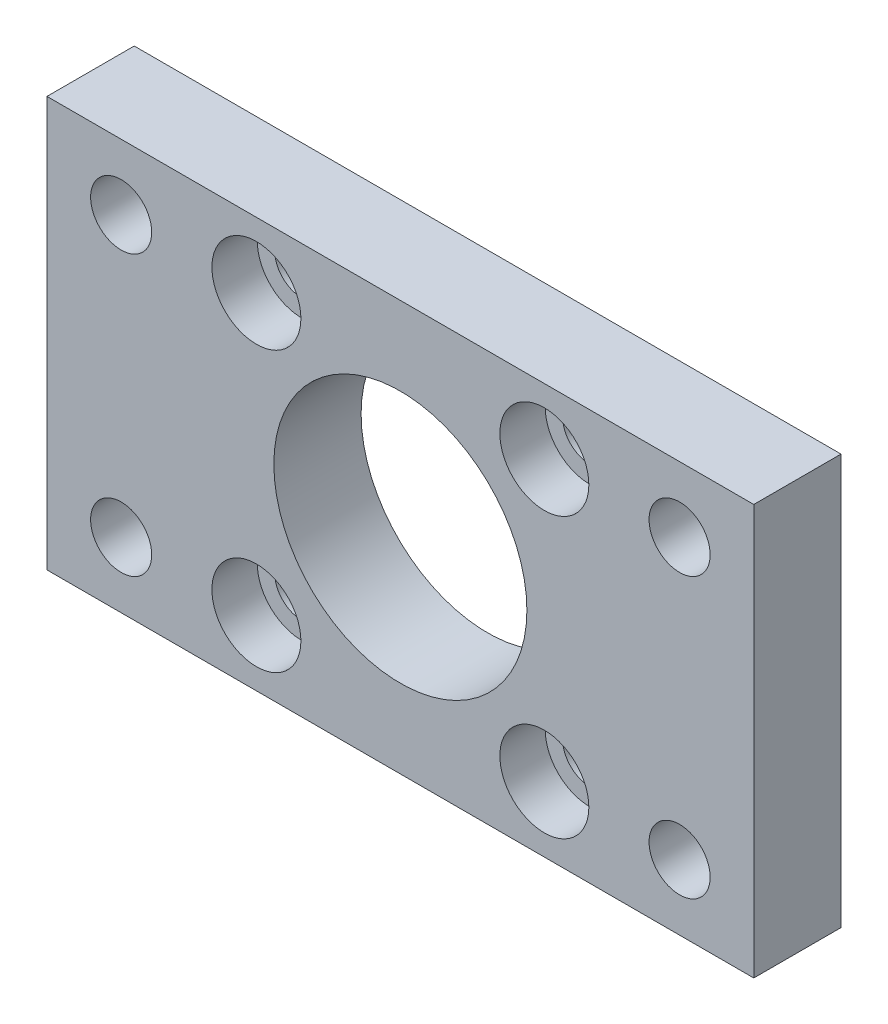
ISO-10303-21;
HEADER;
FILE_DESCRIPTION(('STEP AP214'),'2;1');
FILE_NAME('part.step','',(''),(''),'','','');
FILE_SCHEMA(('AUTOMOTIVE_DESIGN { 1 0 10303 214 1 1 1 1 }'));
ENDSEC;
DATA;
#1=APPLICATION_CONTEXT('core data for automotive mechanical design processes');
#2=APPLICATION_PROTOCOL_DEFINITION('international standard','automotive_design',2000,#1);
#3=PRODUCT_CONTEXT('',#1,'mechanical');
#4=PRODUCT('Part','Part','',(#3));
#5=PRODUCT_RELATED_PRODUCT_CATEGORY('part','',(#4));
#6=PRODUCT_DEFINITION_FORMATION('','',#4);
#7=PRODUCT_DEFINITION_CONTEXT('part definition',#1,'design');
#8=PRODUCT_DEFINITION('design','',#6,#7);
#9=PRODUCT_DEFINITION_SHAPE('','',#8);
#10=(LENGTH_UNIT() NAMED_UNIT(*) SI_UNIT(.MILLI.,.METRE.));
#11=(NAMED_UNIT(*) PLANE_ANGLE_UNIT() SI_UNIT($,.RADIAN.));
#12=(NAMED_UNIT(*) SI_UNIT($,.STERADIAN.) SOLID_ANGLE_UNIT());
#13=UNCERTAINTY_MEASURE_WITH_UNIT(LENGTH_MEASURE(1.E-05),#10,'distance_accuracy_value','');
#14=(GEOMETRIC_REPRESENTATION_CONTEXT(3) GLOBAL_UNCERTAINTY_ASSIGNED_CONTEXT((#13)) GLOBAL_UNIT_ASSIGNED_CONTEXT((#10,
#11,#12)) REPRESENTATION_CONTEXT('',''));
#15=CARTESIAN_POINT('',(0.,0.,0.));
#16=DIRECTION('',(0.,0.,1.));
#17=DIRECTION('',(1.,0.,0.));
#18=AXIS2_PLACEMENT_3D('',#15,#16,#17);
#19=CARTESIAN_POINT('',(57.,39.5,10.));
#20=DIRECTION('',(0.,0.,-1.));
#21=DIRECTION('',(-1.,0.,0.));
#22=AXIS2_PLACEMENT_3D('',#19,#20,#21);
#23=CYLINDRICAL_SURFACE('',#22,3.1);
#24=CARTESIAN_POINT('',(57.,39.5,0.));
#25=DIRECTION('',(0.,0.,1.));
#26=DIRECTION('',(-1.,0.,0.));
#27=AXIS2_PLACEMENT_3D('',#24,#25,#26);
#28=CIRCLE('',#27,3.1);
#29=CARTESIAN_POINT('',(53.9,39.5,0.));
#30=VERTEX_POINT('',#29);
#31=EDGE_CURVE('E138',#30,#30,#28,.T.);
#32=ORIENTED_EDGE('',*,*,#31,.F.);
#33=EDGE_LOOP('',(#32));
#34=FACE_BOUND('',#33,.T.);
#35=CARTESIAN_POINT('',(57.,39.5,4.8));
#36=DIRECTION('',(0.,0.,1.));
#37=DIRECTION('',(1.,0.,0.));
#38=AXIS2_PLACEMENT_3D('',#35,#36,#37);
#39=CIRCLE('',#38,3.1);
#40=CARTESIAN_POINT('',(60.1,39.5,4.8));
#41=VERTEX_POINT('',#40);
#42=EDGE_CURVE('E36',#41,#41,#39,.T.);
#43=ORIENTED_EDGE('',*,*,#42,.T.);
#44=EDGE_LOOP('',(#43));
#45=FACE_BOUND('',#44,.T.);
#46=ADVANCED_FACE('F32',(#34,#45),#23,.F.);
#47=CARTESIAN_POINT('',(57.,7.50000000000001,10.));
#48=DIRECTION('',(0.,0.,-1.));
#49=DIRECTION('',(-1.,0.,0.));
#50=AXIS2_PLACEMENT_3D('',#47,#48,#49);
#51=CYLINDRICAL_SURFACE('',#50,3.1);
#52=CARTESIAN_POINT('',(57.,7.50000000000001,0.));
#53=DIRECTION('',(0.,0.,1.));
#54=DIRECTION('',(1.,0.,0.));
#55=AXIS2_PLACEMENT_3D('',#52,#53,#54);
#56=CIRCLE('',#55,3.1);
#57=CARTESIAN_POINT('',(60.1,7.50000000000001,0.));
#58=VERTEX_POINT('',#57);
#59=EDGE_CURVE('E135',#58,#58,#56,.T.);
#60=ORIENTED_EDGE('',*,*,#59,.F.);
#61=EDGE_LOOP('',(#60));
#62=FACE_BOUND('',#61,.T.);
#63=CARTESIAN_POINT('',(57.,7.50000000000001,4.8));
#64=DIRECTION('',(0.,0.,1.));
#65=DIRECTION('',(1.,0.,0.));
#66=AXIS2_PLACEMENT_3D('',#63,#64,#65);
#67=CIRCLE('',#66,3.1);
#68=CARTESIAN_POINT('',(60.1,7.50000000000001,4.8));
#69=VERTEX_POINT('',#68);
#70=EDGE_CURVE('E116',#69,#69,#67,.T.);
#71=ORIENTED_EDGE('',*,*,#70,.T.);
#72=EDGE_LOOP('',(#71));
#73=FACE_BOUND('',#72,.T.);
#74=ADVANCED_FACE('F193',(#62,#73),#51,.F.);
#75=CARTESIAN_POINT('',(24.,7.50000000000001,10.));
#76=DIRECTION('',(0.,0.,-1.));
#77=DIRECTION('',(-1.,0.,0.));
#78=AXIS2_PLACEMENT_3D('',#75,#76,#77);
#79=CYLINDRICAL_SURFACE('',#78,3.1);
#80=CARTESIAN_POINT('',(24.,7.50000000000001,0.));
#81=DIRECTION('',(0.,0.,1.));
#82=DIRECTION('',(-1.,0.,0.));
#83=AXIS2_PLACEMENT_3D('',#80,#81,#82);
#84=CIRCLE('',#83,3.1);
#85=CARTESIAN_POINT('',(20.9,7.50000000000001,0.));
#86=VERTEX_POINT('',#85);
#87=EDGE_CURVE('E112',#86,#86,#84,.T.);
#88=ORIENTED_EDGE('',*,*,#87,.F.);
#89=EDGE_LOOP('',(#88));
#90=FACE_BOUND('',#89,.T.);
#91=CARTESIAN_POINT('',(24.,7.50000000000001,4.8));
#92=DIRECTION('',(0.,0.,1.));
#93=DIRECTION('',(1.,0.,0.));
#94=AXIS2_PLACEMENT_3D('',#91,#92,#93);
#95=CIRCLE('',#94,3.1);
#96=CARTESIAN_POINT('',(27.1,7.50000000000001,4.8));
#97=VERTEX_POINT('',#96);
#98=EDGE_CURVE('E114',#97,#97,#95,.T.);
#99=ORIENTED_EDGE('',*,*,#98,.T.);
#100=EDGE_LOOP('',(#99));
#101=FACE_BOUND('',#100,.T.);
#102=ADVANCED_FACE('F199',(#90,#101),#79,.F.);
#103=CARTESIAN_POINT('',(24.,39.5,10.));
#104=DIRECTION('',(0.,0.,-1.));
#105=DIRECTION('',(-1.,0.,0.));
#106=AXIS2_PLACEMENT_3D('',#103,#104,#105);
#107=CYLINDRICAL_SURFACE('',#106,3.1);
#108=CARTESIAN_POINT('',(24.,39.5,0.));
#109=DIRECTION('',(0.,0.,1.));
#110=DIRECTION('',(1.,0.,0.));
#111=AXIS2_PLACEMENT_3D('',#108,#109,#110);
#112=CIRCLE('',#111,3.1);
#113=CARTESIAN_POINT('',(27.1,39.5,0.));
#114=VERTEX_POINT('',#113);
#115=EDGE_CURVE('E141',#114,#114,#112,.T.);
#116=ORIENTED_EDGE('',*,*,#115,.F.);
#117=EDGE_LOOP('',(#116));
#118=FACE_BOUND('',#117,.T.);
#119=CARTESIAN_POINT('',(24.,39.5,4.8));
#120=DIRECTION('',(0.,0.,1.));
#121=DIRECTION('',(1.,0.,0.));
#122=AXIS2_PLACEMENT_3D('',#119,#120,#121);
#123=CIRCLE('',#122,3.1);
#124=CARTESIAN_POINT('',(27.1,39.5,4.8));
#125=VERTEX_POINT('',#124);
#126=EDGE_CURVE('E109',#125,#125,#123,.T.);
#127=ORIENTED_EDGE('',*,*,#126,.T.);
#128=EDGE_LOOP('',(#127));
#129=FACE_BOUND('',#128,.T.);
#130=ADVANCED_FACE('F205',(#118,#129),#107,.F.);
#131=CARTESIAN_POINT('',(0.,0.,10.));
#132=DIRECTION('',(0.,0.,-1.));
#133=DIRECTION('',(-1.,0.,0.));
#134=AXIS2_PLACEMENT_3D('',#131,#132,#133);
#135=PLANE('',#134);
#136=CARTESIAN_POINT('',(24.,7.50000000000001,10.));
#137=DIRECTION('',(0.,0.,1.));
#138=DIRECTION('',(1.,0.,0.));
#139=AXIS2_PLACEMENT_3D('',#136,#137,#138);
#140=CIRCLE('',#139,5.1);
#141=CARTESIAN_POINT('',(29.1,7.50000000000001,10.));
#142=VERTEX_POINT('',#141);
#143=EDGE_CURVE('E247',#142,#142,#140,.T.);
#144=ORIENTED_EDGE('',*,*,#143,.F.);
#145=EDGE_LOOP('',(#144));
#146=FACE_BOUND('',#145,.T.);
#147=CARTESIAN_POINT('',(57.,7.50000000000001,10.));
#148=DIRECTION('',(0.,0.,1.));
#149=DIRECTION('',(1.,0.,0.));
#150=AXIS2_PLACEMENT_3D('',#147,#148,#149);
#151=CIRCLE('',#150,5.1);
#152=CARTESIAN_POINT('',(62.1,7.50000000000001,10.));
#153=VERTEX_POINT('',#152);
#154=EDGE_CURVE('E255',#153,#153,#151,.T.);
#155=ORIENTED_EDGE('',*,*,#154,.F.);
#156=EDGE_LOOP('',(#155));
#157=FACE_BOUND('',#156,.T.);
#158=CARTESIAN_POINT('',(57.,39.5,10.));
#159=DIRECTION('',(0.,0.,1.));
#160=DIRECTION('',(1.,0.,0.));
#161=AXIS2_PLACEMENT_3D('',#158,#159,#160);
#162=CIRCLE('',#161,5.1);
#163=CARTESIAN_POINT('',(62.1,39.5,10.));
#164=VERTEX_POINT('',#163);
#165=EDGE_CURVE('E260',#164,#164,#162,.T.);
#166=ORIENTED_EDGE('',*,*,#165,.F.);
#167=EDGE_LOOP('',(#166));
#168=FACE_BOUND('',#167,.T.);
#169=CARTESIAN_POINT('',(24.,39.5,10.));
#170=DIRECTION('',(0.,0.,1.));
#171=DIRECTION('',(1.,0.,0.));
#172=AXIS2_PLACEMENT_3D('',#169,#170,#171);
#173=CIRCLE('',#172,5.1);
#174=CARTESIAN_POINT('',(29.1,39.5,10.));
#175=VERTEX_POINT('',#174);
#176=EDGE_CURVE('E122',#175,#175,#173,.T.);
#177=ORIENTED_EDGE('',*,*,#176,.F.);
#178=EDGE_LOOP('',(#177));
#179=FACE_BOUND('',#178,.T.);
#180=DIRECTION('',(0.,-1.,0.));
#181=VECTOR('',#180,1.);
#182=CARTESIAN_POINT('',(0.,0.,10.));
#183=LINE('',#182,#181);
#184=CARTESIAN_POINT('',(0.,47.,10.));
#185=VERTEX_POINT('',#184);
#186=CARTESIAN_POINT('',(0.,0.,10.));
#187=VERTEX_POINT('',#186);
#188=EDGE_CURVE('E87',#185,#187,#183,.T.);
#189=ORIENTED_EDGE('',*,*,#188,.T.);
#190=DIRECTION('',(1.,0.,0.));
#191=VECTOR('',#190,1.);
#192=CARTESIAN_POINT('',(0.,0.,10.));
#193=LINE('',#192,#191);
#194=CARTESIAN_POINT('',(81.,0.,10.));
#195=VERTEX_POINT('',#194);
#196=EDGE_CURVE('E81',#187,#195,#193,.T.);
#197=ORIENTED_EDGE('',*,*,#196,.T.);
#198=DIRECTION('',(0.,1.,0.));
#199=VECTOR('',#198,1.);
#200=CARTESIAN_POINT('',(81.,0.,10.));
#201=LINE('',#200,#199);
#202=CARTESIAN_POINT('',(81.,47.,10.));
#203=VERTEX_POINT('',#202);
#204=EDGE_CURVE('E85',#195,#203,#201,.T.);
#205=ORIENTED_EDGE('',*,*,#204,.T.);
#206=DIRECTION('',(-1.,0.,0.));
#207=VECTOR('',#206,1.);
#208=CARTESIAN_POINT('',(0.,47.,10.));
#209=LINE('',#208,#207);
#210=EDGE_CURVE('E51',#203,#185,#209,.T.);
#211=ORIENTED_EDGE('',*,*,#210,.T.);
#212=EDGE_LOOP('',(#189,#197,#205,#211));
#213=FACE_BOUND('',#212,.T.);
#214=CARTESIAN_POINT('',(40.5,23.5,10.));
#215=DIRECTION('',(0.,0.,1.));
#216=DIRECTION('',(1.,0.,0.));
#217=AXIS2_PLACEMENT_3D('',#214,#215,#216);
#218=CIRCLE('',#217,14.5);
#219=CARTESIAN_POINT('',(55.,23.5,10.));
#220=VERTEX_POINT('',#219);
#221=EDGE_CURVE('E103',#220,#220,#218,.T.);
#222=ORIENTED_EDGE('',*,*,#221,.F.);
#223=EDGE_LOOP('',(#222));
#224=FACE_BOUND('',#223,.T.);
#225=CARTESIAN_POINT('',(8.50000000000001,39.5,10.));
#226=DIRECTION('',(0.,0.,1.));
#227=DIRECTION('',(1.,0.,0.));
#228=AXIS2_PLACEMENT_3D('',#225,#226,#227);
#229=CIRCLE('',#228,3.5);
#230=CARTESIAN_POINT('',(12.,39.5,10.));
#231=VERTEX_POINT('',#230);
#232=EDGE_CURVE('E163',#231,#231,#229,.T.);
#233=ORIENTED_EDGE('',*,*,#232,.F.);
#234=EDGE_LOOP('',(#233));
#235=FACE_BOUND('',#234,.T.);
#236=CARTESIAN_POINT('',(72.5,39.5,10.));
#237=DIRECTION('',(0.,0.,1.));
#238=DIRECTION('',(1.,0.,0.));
#239=AXIS2_PLACEMENT_3D('',#236,#237,#238);
#240=CIRCLE('',#239,3.49999999999999);
#241=CARTESIAN_POINT('',(76.,39.5,10.));
#242=VERTEX_POINT('',#241);
#243=EDGE_CURVE('E157',#242,#242,#240,.T.);
#244=ORIENTED_EDGE('',*,*,#243,.F.);
#245=EDGE_LOOP('',(#244));
#246=FACE_BOUND('',#245,.T.);
#247=CARTESIAN_POINT('',(72.5,7.50000000000001,10.));
#248=DIRECTION('',(0.,0.,1.));
#249=DIRECTION('',(1.,0.,0.));
#250=AXIS2_PLACEMENT_3D('',#247,#248,#249);
#251=CIRCLE('',#250,3.50000000000001);
#252=CARTESIAN_POINT('',(76.,7.50000000000001,10.));
#253=VERTEX_POINT('',#252);
#254=EDGE_CURVE('E151',#253,#253,#251,.T.);
#255=ORIENTED_EDGE('',*,*,#254,.F.);
#256=EDGE_LOOP('',(#255));
#257=FACE_BOUND('',#256,.T.);
#258=CARTESIAN_POINT('',(8.50000000000001,7.5,10.));
#259=DIRECTION('',(0.,0.,1.));
#260=DIRECTION('',(1.,0.,0.));
#261=AXIS2_PLACEMENT_3D('',#258,#259,#260);
#262=CIRCLE('',#261,3.5);
#263=CARTESIAN_POINT('',(12.,7.5,10.));
#264=VERTEX_POINT('',#263);
#265=EDGE_CURVE('E145',#264,#264,#262,.T.);
#266=ORIENTED_EDGE('',*,*,#265,.F.);
#267=EDGE_LOOP('',(#266));
#268=FACE_BOUND('',#267,.T.);
#269=ADVANCED_FACE('F82',(#146,#157,#168,#179,#213,#224,#235,#246,#257,#268),#135,.F.);
#270=CARTESIAN_POINT('',(0.,0.,0.));
#271=DIRECTION('',(0.,0.,-1.));
#272=DIRECTION('',(-1.,0.,0.));
#273=AXIS2_PLACEMENT_3D('',#270,#271,#272);
#274=PLANE('',#273);
#275=ORIENTED_EDGE('',*,*,#59,.T.);
#276=EDGE_LOOP('',(#275));
#277=FACE_BOUND('',#276,.T.);
#278=ORIENTED_EDGE('',*,*,#115,.T.);
#279=EDGE_LOOP('',(#278));
#280=FACE_BOUND('',#279,.T.);
#281=CARTESIAN_POINT('',(72.5,7.50000000000001,0.));
#282=DIRECTION('',(0.,0.,1.));
#283=DIRECTION('',(1.,0.,0.));
#284=AXIS2_PLACEMENT_3D('',#281,#282,#283);
#285=CIRCLE('',#284,3.50000000000001);
#286=CARTESIAN_POINT('',(76.,7.50000000000001,0.));
#287=VERTEX_POINT('',#286);
#288=EDGE_CURVE('E148',#287,#287,#285,.T.);
#289=ORIENTED_EDGE('',*,*,#288,.T.);
#290=EDGE_LOOP('',(#289));
#291=FACE_BOUND('',#290,.T.);
#292=CARTESIAN_POINT('',(8.50000000000001,39.5,0.));
#293=DIRECTION('',(0.,0.,1.));
#294=DIRECTION('',(1.,0.,0.));
#295=AXIS2_PLACEMENT_3D('',#292,#293,#294);
#296=CIRCLE('',#295,3.5);
#297=CARTESIAN_POINT('',(12.,39.5,0.));
#298=VERTEX_POINT('',#297);
#299=EDGE_CURVE('E160',#298,#298,#296,.T.);
#300=ORIENTED_EDGE('',*,*,#299,.T.);
#301=EDGE_LOOP('',(#300));
#302=FACE_BOUND('',#301,.T.);
#303=DIRECTION('',(0.,-1.,0.));
#304=VECTOR('',#303,1.);
#305=CARTESIAN_POINT('',(0.,0.,0.));
#306=LINE('',#305,#304);
#307=CARTESIAN_POINT('',(0.,47.,0.));
#308=VERTEX_POINT('',#307);
#309=CARTESIAN_POINT('',(0.,0.,0.));
#310=VERTEX_POINT('',#309);
#311=EDGE_CURVE('E100',#308,#310,#306,.T.);
#312=ORIENTED_EDGE('',*,*,#311,.F.);
#313=DIRECTION('',(-1.,0.,0.));
#314=VECTOR('',#313,1.);
#315=CARTESIAN_POINT('',(0.,47.,0.));
#316=LINE('',#315,#314);
#317=CARTESIAN_POINT('',(81.,47.,0.));
#318=VERTEX_POINT('',#317);
#319=EDGE_CURVE('E74',#318,#308,#316,.T.);
#320=ORIENTED_EDGE('',*,*,#319,.F.);
#321=DIRECTION('',(0.,1.,0.));
#322=VECTOR('',#321,1.);
#323=CARTESIAN_POINT('',(81.,0.,0.));
#324=LINE('',#323,#322);
#325=CARTESIAN_POINT('',(81.,0.,0.));
#326=VERTEX_POINT('',#325);
#327=EDGE_CURVE('E68',#326,#318,#324,.T.);
#328=ORIENTED_EDGE('',*,*,#327,.F.);
#329=DIRECTION('',(1.,0.,0.));
#330=VECTOR('',#329,1.);
#331=CARTESIAN_POINT('',(0.,0.,0.));
#332=LINE('',#331,#330);
#333=EDGE_CURVE('E91',#310,#326,#332,.T.);
#334=ORIENTED_EDGE('',*,*,#333,.F.);
#335=EDGE_LOOP('',(#312,#320,#328,#334));
#336=FACE_BOUND('',#335,.T.);
#337=CARTESIAN_POINT('',(40.5,23.5,0.));
#338=DIRECTION('',(0.,0.,1.));
#339=DIRECTION('',(1.,0.,0.));
#340=AXIS2_PLACEMENT_3D('',#337,#338,#339);
#341=CIRCLE('',#340,14.5);
#342=CARTESIAN_POINT('',(55.,23.5,0.));
#343=VERTEX_POINT('',#342);
#344=EDGE_CURVE('E166',#343,#343,#341,.T.);
#345=ORIENTED_EDGE('',*,*,#344,.T.);
#346=EDGE_LOOP('',(#345));
#347=FACE_BOUND('',#346,.T.);
#348=CARTESIAN_POINT('',(72.5,39.5,0.));
#349=DIRECTION('',(0.,0.,1.));
#350=DIRECTION('',(1.,0.,0.));
#351=AXIS2_PLACEMENT_3D('',#348,#349,#350);
#352=CIRCLE('',#351,3.49999999999999);
#353=CARTESIAN_POINT('',(76.,39.5,0.));
#354=VERTEX_POINT('',#353);
#355=EDGE_CURVE('E154',#354,#354,#352,.T.);
#356=ORIENTED_EDGE('',*,*,#355,.T.);
#357=EDGE_LOOP('',(#356));
#358=FACE_BOUND('',#357,.T.);
#359=CARTESIAN_POINT('',(8.50000000000001,7.5,0.));
#360=DIRECTION('',(0.,0.,1.));
#361=DIRECTION('',(1.,0.,0.));
#362=AXIS2_PLACEMENT_3D('',#359,#360,#361);
#363=CIRCLE('',#362,3.5);
#364=CARTESIAN_POINT('',(12.,7.5,0.));
#365=VERTEX_POINT('',#364);
#366=EDGE_CURVE('E144',#365,#365,#363,.T.);
#367=ORIENTED_EDGE('',*,*,#366,.T.);
#368=EDGE_LOOP('',(#367));
#369=FACE_BOUND('',#368,.T.);
#370=ORIENTED_EDGE('',*,*,#31,.T.);
#371=EDGE_LOOP('',(#370));
#372=FACE_BOUND('',#371,.T.);
#373=ORIENTED_EDGE('',*,*,#87,.T.);
#374=EDGE_LOOP('',(#373));
#375=FACE_BOUND('',#374,.T.);
#376=ADVANCED_FACE('F174',(#277,#280,#291,#302,#336,#347,#358,#369,#372,#375),#274,.T.);
#377=CARTESIAN_POINT('',(0.,0.,10.));
#378=DIRECTION('',(1.,0.,0.));
#379=DIRECTION('',(0.,0.,-1.));
#380=AXIS2_PLACEMENT_3D('',#377,#378,#379);
#381=PLANE('',#380);
#382=ORIENTED_EDGE('',*,*,#311,.T.);
#383=DIRECTION('',(0.,0.,-1.));
#384=VECTOR('',#383,1.);
#385=CARTESIAN_POINT('',(0.,0.,10.));
#386=LINE('',#385,#384);
#387=EDGE_CURVE('E11',#187,#310,#386,.T.);
#388=ORIENTED_EDGE('',*,*,#387,.F.);
#389=ORIENTED_EDGE('',*,*,#188,.F.);
#390=DIRECTION('',(0.,0.,-1.));
#391=VECTOR('',#390,1.);
#392=CARTESIAN_POINT('',(0.,47.,10.));
#393=LINE('',#392,#391);
#394=EDGE_CURVE('E96',#185,#308,#393,.T.);
#395=ORIENTED_EDGE('',*,*,#394,.T.);
#396=EDGE_LOOP('',(#382,#388,#389,#395));
#397=FACE_BOUND('',#396,.T.);
#398=ADVANCED_FACE('F34',(#397),#381,.F.);
#399=CARTESIAN_POINT('',(0.,0.,10.));
#400=DIRECTION('',(0.,1.,0.));
#401=DIRECTION('',(-1.,0.,0.));
#402=AXIS2_PLACEMENT_3D('',#399,#400,#401);
#403=PLANE('',#402);
#404=ORIENTED_EDGE('',*,*,#333,.T.);
#405=DIRECTION('',(0.,0.,-1.));
#406=VECTOR('',#405,1.);
#407=CARTESIAN_POINT('',(81.,0.,10.));
#408=LINE('',#407,#406);
#409=EDGE_CURVE('E42',#195,#326,#408,.T.);
#410=ORIENTED_EDGE('',*,*,#409,.F.);
#411=ORIENTED_EDGE('',*,*,#196,.F.);
#412=ORIENTED_EDGE('',*,*,#387,.T.);
#413=EDGE_LOOP('',(#404,#410,#411,#412));
#414=FACE_BOUND('',#413,.T.);
#415=ADVANCED_FACE('F90',(#414),#403,.F.);
#416=CARTESIAN_POINT('',(81.,0.,10.));
#417=DIRECTION('',(-1.,0.,0.));
#418=DIRECTION('',(0.,0.,1.));
#419=AXIS2_PLACEMENT_3D('',#416,#417,#418);
#420=PLANE('',#419);
#421=ORIENTED_EDGE('',*,*,#327,.T.);
#422=DIRECTION('',(0.,0.,-1.));
#423=VECTOR('',#422,1.);
#424=CARTESIAN_POINT('',(81.,47.,10.));
#425=LINE('',#424,#423);
#426=EDGE_CURVE('E92',#203,#318,#425,.T.);
#427=ORIENTED_EDGE('',*,*,#426,.F.);
#428=ORIENTED_EDGE('',*,*,#204,.F.);
#429=ORIENTED_EDGE('',*,*,#409,.T.);
#430=EDGE_LOOP('',(#421,#427,#428,#429));
#431=FACE_BOUND('',#430,.T.);
#432=ADVANCED_FACE('F94',(#431),#420,.F.);
#433=CARTESIAN_POINT('',(0.,47.,10.));
#434=DIRECTION('',(0.,-1.,0.));
#435=DIRECTION('',(1.,0.,0.));
#436=AXIS2_PLACEMENT_3D('',#433,#434,#435);
#437=PLANE('',#436);
#438=ORIENTED_EDGE('',*,*,#319,.T.);
#439=ORIENTED_EDGE('',*,*,#394,.F.);
#440=ORIENTED_EDGE('',*,*,#210,.F.);
#441=ORIENTED_EDGE('',*,*,#426,.T.);
#442=EDGE_LOOP('',(#438,#439,#440,#441));
#443=FACE_BOUND('',#442,.T.);
#444=ADVANCED_FACE('F180',(#443),#437,.F.);
#445=CARTESIAN_POINT('',(40.5,23.5,10.));
#446=DIRECTION('',(0.,0.,-1.));
#447=DIRECTION('',(-1.,0.,0.));
#448=AXIS2_PLACEMENT_3D('',#445,#446,#447);
#449=CYLINDRICAL_SURFACE('',#448,14.5);
#450=ORIENTED_EDGE('',*,*,#221,.T.);
#451=EDGE_LOOP('',(#450));
#452=FACE_BOUND('',#451,.T.);
#453=ORIENTED_EDGE('',*,*,#344,.F.);
#454=EDGE_LOOP('',(#453));
#455=FACE_BOUND('',#454,.T.);
#456=ADVANCED_FACE('F177',(#452,#455),#449,.F.);
#457=CARTESIAN_POINT('',(8.50000000000001,39.5,10.));
#458=DIRECTION('',(0.,0.,-1.));
#459=DIRECTION('',(-1.,0.,0.));
#460=AXIS2_PLACEMENT_3D('',#457,#458,#459);
#461=CYLINDRICAL_SURFACE('',#460,3.5);
#462=ORIENTED_EDGE('',*,*,#232,.T.);
#463=EDGE_LOOP('',(#462));
#464=FACE_BOUND('',#463,.T.);
#465=ORIENTED_EDGE('',*,*,#299,.F.);
#466=EDGE_LOOP('',(#465));
#467=FACE_BOUND('',#466,.T.);
#468=ADVANCED_FACE('F179',(#464,#467),#461,.F.);
#469=CARTESIAN_POINT('',(72.5,39.5,10.));
#470=DIRECTION('',(0.,0.,-1.));
#471=DIRECTION('',(-1.,0.,0.));
#472=AXIS2_PLACEMENT_3D('',#469,#470,#471);
#473=CYLINDRICAL_SURFACE('',#472,3.49999999999999);
#474=ORIENTED_EDGE('',*,*,#243,.T.);
#475=EDGE_LOOP('',(#474));
#476=FACE_BOUND('',#475,.T.);
#477=ORIENTED_EDGE('',*,*,#355,.F.);
#478=EDGE_LOOP('',(#477));
#479=FACE_BOUND('',#478,.T.);
#480=ADVANCED_FACE('F187',(#476,#479),#473,.F.);
#481=CARTESIAN_POINT('',(72.5,7.50000000000001,10.));
#482=DIRECTION('',(0.,0.,-1.));
#483=DIRECTION('',(-1.,0.,0.));
#484=AXIS2_PLACEMENT_3D('',#481,#482,#483);
#485=CYLINDRICAL_SURFACE('',#484,3.50000000000001);
#486=ORIENTED_EDGE('',*,*,#254,.T.);
#487=EDGE_LOOP('',(#486));
#488=FACE_BOUND('',#487,.T.);
#489=ORIENTED_EDGE('',*,*,#288,.F.);
#490=EDGE_LOOP('',(#489));
#491=FACE_BOUND('',#490,.T.);
#492=ADVANCED_FACE('F213',(#488,#491),#485,.F.);
#493=CARTESIAN_POINT('',(8.50000000000001,7.5,10.));
#494=DIRECTION('',(0.,0.,-1.));
#495=DIRECTION('',(-1.,0.,0.));
#496=AXIS2_PLACEMENT_3D('',#493,#494,#495);
#497=CYLINDRICAL_SURFACE('',#496,3.5);
#498=ORIENTED_EDGE('',*,*,#265,.T.);
#499=EDGE_LOOP('',(#498));
#500=FACE_BOUND('',#499,.T.);
#501=ORIENTED_EDGE('',*,*,#366,.F.);
#502=EDGE_LOOP('',(#501));
#503=FACE_BOUND('',#502,.T.);
#504=ADVANCED_FACE('F209',(#500,#503),#497,.F.);
#505=CARTESIAN_POINT('',(24.,39.5,4.8));
#506=DIRECTION('',(0.,0.,1.));
#507=DIRECTION('',(1.,0.,0.));
#508=AXIS2_PLACEMENT_3D('',#505,#506,#507);
#509=CYLINDRICAL_SURFACE('',#508,5.1);
#510=CARTESIAN_POINT('',(24.,39.5,4.8));
#511=DIRECTION('',(0.,0.,1.));
#512=DIRECTION('',(1.,0.,0.));
#513=AXIS2_PLACEMENT_3D('',#510,#511,#512);
#514=CIRCLE('',#513,5.1);
#515=CARTESIAN_POINT('',(29.1,39.5,4.8));
#516=VERTEX_POINT('',#515);
#517=EDGE_CURVE('E113',#516,#516,#514,.T.);
#518=ORIENTED_EDGE('',*,*,#517,.F.);
#519=EDGE_LOOP('',(#518));
#520=FACE_BOUND('',#519,.T.);
#521=ORIENTED_EDGE('',*,*,#176,.T.);
#522=EDGE_LOOP('',(#521));
#523=FACE_BOUND('',#522,.T.);
#524=ADVANCED_FACE('F212',(#520,#523),#509,.F.);
#525=CARTESIAN_POINT('',(24.,39.5,4.8));
#526=DIRECTION('',(0.,0.,1.));
#527=DIRECTION('',(1.,0.,0.));
#528=AXIS2_PLACEMENT_3D('',#525,#526,#527);
#529=PLANE('',#528);
#530=ORIENTED_EDGE('',*,*,#126,.F.);
#531=EDGE_LOOP('',(#530));
#532=FACE_BOUND('',#531,.T.);
#533=ORIENTED_EDGE('',*,*,#517,.T.);
#534=EDGE_LOOP('',(#533));
#535=FACE_BOUND('',#534,.T.);
#536=ADVANCED_FACE('F359',(#532,#535),#529,.T.);
#537=CARTESIAN_POINT('',(24.,7.50000000000001,4.8));
#538=DIRECTION('',(0.,0.,1.));
#539=DIRECTION('',(1.,0.,0.));
#540=AXIS2_PLACEMENT_3D('',#537,#538,#539);
#541=CYLINDRICAL_SURFACE('',#540,5.1);
#542=CARTESIAN_POINT('',(24.,7.50000000000001,4.8));
#543=DIRECTION('',(0.,0.,1.));
#544=DIRECTION('',(1.,0.,0.));
#545=AXIS2_PLACEMENT_3D('',#542,#543,#544);
#546=CIRCLE('',#545,5.1);
#547=CARTESIAN_POINT('',(29.1,7.50000000000001,4.8));
#548=VERTEX_POINT('',#547);
#549=EDGE_CURVE('E117',#548,#548,#546,.T.);
#550=ORIENTED_EDGE('',*,*,#549,.F.);
#551=EDGE_LOOP('',(#550));
#552=FACE_BOUND('',#551,.T.);
#553=ORIENTED_EDGE('',*,*,#143,.T.);
#554=EDGE_LOOP('',(#553));
#555=FACE_BOUND('',#554,.T.);
#556=ADVANCED_FACE('F242',(#552,#555),#541,.F.);
#557=CARTESIAN_POINT('',(24.,7.50000000000001,4.8));
#558=DIRECTION('',(0.,0.,1.));
#559=DIRECTION('',(1.,0.,0.));
#560=AXIS2_PLACEMENT_3D('',#557,#558,#559);
#561=PLANE('',#560);
#562=ORIENTED_EDGE('',*,*,#98,.F.);
#563=EDGE_LOOP('',(#562));
#564=FACE_BOUND('',#563,.T.);
#565=ORIENTED_EDGE('',*,*,#549,.T.);
#566=EDGE_LOOP('',(#565));
#567=FACE_BOUND('',#566,.T.);
#568=ADVANCED_FACE('F238',(#564,#567),#561,.T.);
#569=CARTESIAN_POINT('',(57.,7.50000000000001,4.8));
#570=DIRECTION('',(0.,0.,1.));
#571=DIRECTION('',(1.,0.,0.));
#572=AXIS2_PLACEMENT_3D('',#569,#570,#571);
#573=CYLINDRICAL_SURFACE('',#572,5.1);
#574=CARTESIAN_POINT('',(57.,7.50000000000001,4.8));
#575=DIRECTION('',(0.,0.,1.));
#576=DIRECTION('',(1.,0.,0.));
#577=AXIS2_PLACEMENT_3D('',#574,#575,#576);
#578=CIRCLE('',#577,5.1);
#579=CARTESIAN_POINT('',(62.1,7.50000000000001,4.8));
#580=VERTEX_POINT('',#579);
#581=EDGE_CURVE('E250',#580,#580,#578,.T.);
#582=ORIENTED_EDGE('',*,*,#581,.F.);
#583=EDGE_LOOP('',(#582));
#584=FACE_BOUND('',#583,.T.);
#585=ORIENTED_EDGE('',*,*,#154,.T.);
#586=EDGE_LOOP('',(#585));
#587=FACE_BOUND('',#586,.T.);
#588=ADVANCED_FACE('F241',(#584,#587),#573,.F.);
#589=CARTESIAN_POINT('',(57.,7.50000000000001,4.8));
#590=DIRECTION('',(0.,0.,1.));
#591=DIRECTION('',(1.,0.,0.));
#592=AXIS2_PLACEMENT_3D('',#589,#590,#591);
#593=PLANE('',#592);
#594=ORIENTED_EDGE('',*,*,#70,.F.);
#595=EDGE_LOOP('',(#594));
#596=FACE_BOUND('',#595,.T.);
#597=ORIENTED_EDGE('',*,*,#581,.T.);
#598=EDGE_LOOP('',(#597));
#599=FACE_BOUND('',#598,.T.);
#600=ADVANCED_FACE('F388',(#596,#599),#593,.T.);
#601=CARTESIAN_POINT('',(57.,39.5,4.8));
#602=DIRECTION('',(0.,0.,1.));
#603=DIRECTION('',(1.,0.,0.));
#604=AXIS2_PLACEMENT_3D('',#601,#602,#603);
#605=CYLINDRICAL_SURFACE('',#604,5.1);
#606=CARTESIAN_POINT('',(57.,39.5,4.8));
#607=DIRECTION('',(0.,0.,1.));
#608=DIRECTION('',(1.,0.,0.));
#609=AXIS2_PLACEMENT_3D('',#606,#607,#608);
#610=CIRCLE('',#609,5.1);
#611=CARTESIAN_POINT('',(62.1,39.5,4.8));
#612=VERTEX_POINT('',#611);
#613=EDGE_CURVE('E258',#612,#612,#610,.T.);
#614=ORIENTED_EDGE('',*,*,#613,.F.);
#615=EDGE_LOOP('',(#614));
#616=FACE_BOUND('',#615,.T.);
#617=ORIENTED_EDGE('',*,*,#165,.T.);
#618=EDGE_LOOP('',(#617));
#619=FACE_BOUND('',#618,.T.);
#620=ADVANCED_FACE('F264',(#616,#619),#605,.F.);
#621=CARTESIAN_POINT('',(57.,39.5,4.8));
#622=DIRECTION('',(0.,0.,1.));
#623=DIRECTION('',(1.,0.,0.));
#624=AXIS2_PLACEMENT_3D('',#621,#622,#623);
#625=PLANE('',#624);
#626=ORIENTED_EDGE('',*,*,#42,.F.);
#627=EDGE_LOOP('',(#626));
#628=FACE_BOUND('',#627,.T.);
#629=ORIENTED_EDGE('',*,*,#613,.T.);
#630=EDGE_LOOP('',(#629));
#631=FACE_BOUND('',#630,.T.);
#632=ADVANCED_FACE('F405',(#628,#631),#625,.T.);
#633=CLOSED_SHELL('',(#46,#74,#102,#130,#269,#376,#398,#415,#432,#444,#456,#468,#480,#492,#504,
#524,#536,#556,#568,#588,#600,#620,#632));
#634=MANIFOLD_SOLID_BREP('B2',#633);
#635=ADVANCED_BREP_SHAPE_REPRESENTATION('',(#18,#634),#14);
#636=SHAPE_DEFINITION_REPRESENTATION(#9,#635);
ENDSEC;
END-ISO-10303-21;
